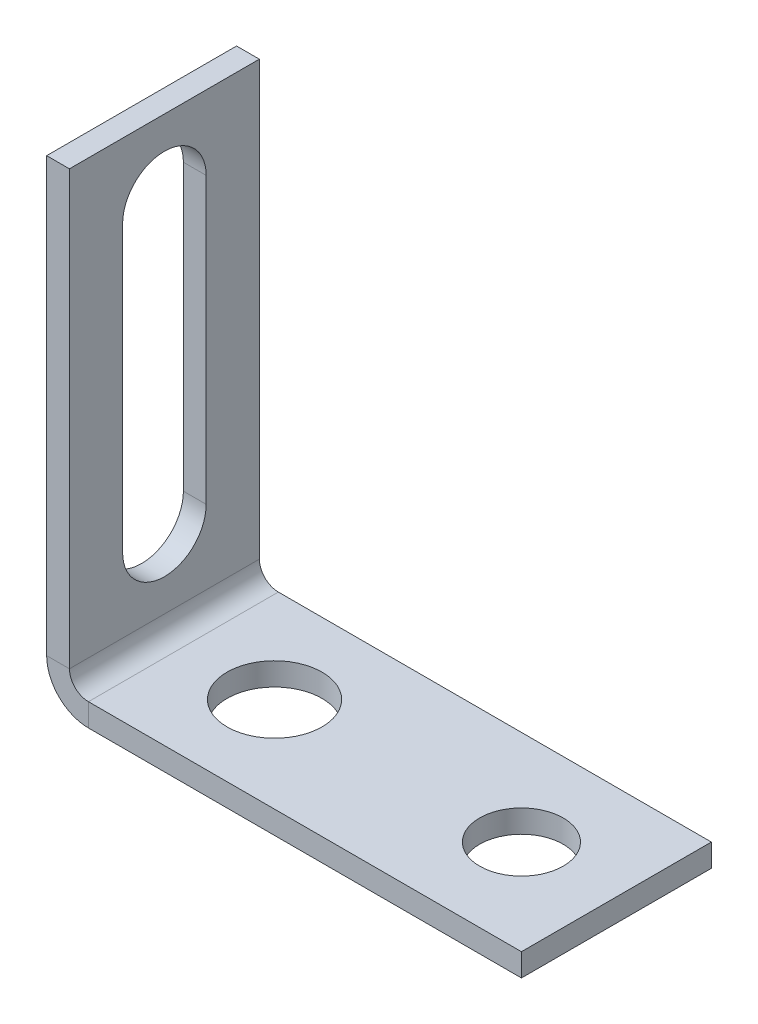
ISO-10303-21;
HEADER;
FILE_DESCRIPTION(('STEP AP214'),'2;1');
FILE_NAME('part.step','',(''),(''),'','','');
FILE_SCHEMA(('AUTOMOTIVE_DESIGN { 1 0 10303 214 1 1 1 1 }'));
ENDSEC;
DATA;
#1=APPLICATION_CONTEXT('core data for automotive mechanical design processes');
#2=APPLICATION_PROTOCOL_DEFINITION('international standard','automotive_design',2000,#1);
#3=PRODUCT_CONTEXT('',#1,'mechanical');
#4=PRODUCT('Part','Part','',(#3));
#5=PRODUCT_RELATED_PRODUCT_CATEGORY('part','',(#4));
#6=PRODUCT_DEFINITION_FORMATION('','',#4);
#7=PRODUCT_DEFINITION_CONTEXT('part definition',#1,'design');
#8=PRODUCT_DEFINITION('design','',#6,#7);
#9=PRODUCT_DEFINITION_SHAPE('','',#8);
#10=(LENGTH_UNIT() NAMED_UNIT(*) SI_UNIT(.MILLI.,.METRE.));
#11=(NAMED_UNIT(*) PLANE_ANGLE_UNIT() SI_UNIT($,.RADIAN.));
#12=(NAMED_UNIT(*) SI_UNIT($,.STERADIAN.) SOLID_ANGLE_UNIT());
#13=UNCERTAINTY_MEASURE_WITH_UNIT(LENGTH_MEASURE(1.E-05),#10,'distance_accuracy_value','');
#14=(GEOMETRIC_REPRESENTATION_CONTEXT(3) GLOBAL_UNCERTAINTY_ASSIGNED_CONTEXT((#13)) GLOBAL_UNIT_ASSIGNED_CONTEXT((#10,
#11,#12)) REPRESENTATION_CONTEXT('',''));
#15=CARTESIAN_POINT('',(0.,0.,0.));
#16=DIRECTION('',(0.,0.,1.));
#17=DIRECTION('',(1.,0.,0.));
#18=AXIS2_PLACEMENT_3D('',#15,#16,#17);
#19=CARTESIAN_POINT('',(0.,2.2,10.));
#20=DIRECTION('',(0.,0.,1.));
#21=DIRECTION('',(1.,0.,0.));
#22=AXIS2_PLACEMENT_3D('',#19,#20,#21);
#23=PLANE('',#22);
#24=DIRECTION('',(1.,0.,0.));
#25=VECTOR('',#24,1.);
#26=CARTESIAN_POINT('',(0.,2.2,10.));
#27=LINE('',#26,#25);
#28=CARTESIAN_POINT('',(0.,2.2,10.));
#29=VERTEX_POINT('',#28);
#30=CARTESIAN_POINT('',(1.2,2.2,10.));
#31=VERTEX_POINT('',#30);
#32=EDGE_CURVE('E11',#29,#31,#27,.T.);
#33=ORIENTED_EDGE('',*,*,#32,.F.);
#34=CARTESIAN_POINT('',(2.2,2.2,10.));
#35=DIRECTION('',(0.,0.,-1.));
#36=DIRECTION('',(-1.,0.,0.));
#37=AXIS2_PLACEMENT_3D('',#34,#35,#36);
#38=CIRCLE('',#37,2.2);
#39=CARTESIAN_POINT('',(2.2,0.,10.));
#40=VERTEX_POINT('',#39);
#41=EDGE_CURVE('E191',#29,#40,#38,.F.);
#42=ORIENTED_EDGE('',*,*,#41,.T.);
#43=DIRECTION('',(0.,-1.,0.));
#44=VECTOR('',#43,1.);
#45=CARTESIAN_POINT('',(2.2,1.2,10.));
#46=LINE('',#45,#44);
#47=CARTESIAN_POINT('',(2.2,1.2,10.));
#48=VERTEX_POINT('',#47);
#49=EDGE_CURVE('E41',#48,#40,#46,.T.);
#50=ORIENTED_EDGE('',*,*,#49,.F.);
#51=CARTESIAN_POINT('',(2.2,2.2,10.));
#52=DIRECTION('',(0.,0.,1.));
#53=DIRECTION('',(1.,0.,0.));
#54=AXIS2_PLACEMENT_3D('',#51,#52,#53);
#55=CIRCLE('',#54,1.);
#56=EDGE_CURVE('E179',#31,#48,#55,.T.);
#57=ORIENTED_EDGE('',*,*,#56,.F.);
#58=EDGE_LOOP('',(#33,#42,#50,#57));
#59=FACE_BOUND('',#58,.T.);
#60=ADVANCED_FACE('F34',(#59),#23,.T.);
#61=CARTESIAN_POINT('',(2.2,1.2,10.));
#62=DIRECTION('',(0.,0.,1.));
#63=DIRECTION('',(1.,0.,0.));
#64=AXIS2_PLACEMENT_3D('',#61,#62,#63);
#65=PLANE('',#64);
#66=DIRECTION('',(0.,-1.,0.));
#67=VECTOR('',#66,1.);
#68=CARTESIAN_POINT('',(0.,25.,10.));
#69=LINE('',#68,#67);
#70=CARTESIAN_POINT('',(0.,25.,10.));
#71=VERTEX_POINT('',#70);
#72=EDGE_CURVE('E188',#71,#29,#69,.T.);
#73=ORIENTED_EDGE('',*,*,#72,.T.);
#74=ORIENTED_EDGE('',*,*,#32,.T.);
#75=DIRECTION('',(0.,-1.,0.));
#76=VECTOR('',#75,1.);
#77=CARTESIAN_POINT('',(1.2,25.,10.));
#78=LINE('',#77,#76);
#79=CARTESIAN_POINT('',(1.2,25.,10.));
#80=VERTEX_POINT('',#79);
#81=EDGE_CURVE('E182',#80,#31,#78,.T.);
#82=ORIENTED_EDGE('',*,*,#81,.F.);
#83=DIRECTION('',(1.,0.,0.));
#84=VECTOR('',#83,1.);
#85=CARTESIAN_POINT('',(0.,25.,10.));
#86=LINE('',#85,#84);
#87=EDGE_CURVE('E185',#71,#80,#86,.T.);
#88=ORIENTED_EDGE('',*,*,#87,.F.);
#89=EDGE_LOOP('',(#73,#74,#82,#88));
#90=FACE_BOUND('',#89,.T.);
#91=ADVANCED_FACE('F272',(#90),#65,.T.);
#92=CARTESIAN_POINT('',(2.2,0.,0.));
#93=DIRECTION('',(0.,0.,-1.));
#94=DIRECTION('',(-1.,0.,0.));
#95=AXIS2_PLACEMENT_3D('',#92,#93,#94);
#96=PLANE('',#95);
#97=DIRECTION('',(0.,1.,0.));
#98=VECTOR('',#97,1.);
#99=CARTESIAN_POINT('',(2.2,0.,0.));
#100=LINE('',#99,#98);
#101=CARTESIAN_POINT('',(2.2,0.,0.));
#102=VERTEX_POINT('',#101);
#103=CARTESIAN_POINT('',(2.2,1.2,0.));
#104=VERTEX_POINT('',#103);
#105=EDGE_CURVE('E238',#102,#104,#100,.T.);
#106=ORIENTED_EDGE('',*,*,#105,.F.);
#107=CARTESIAN_POINT('',(2.2,2.2,0.));
#108=DIRECTION('',(0.,0.,-1.));
#109=DIRECTION('',(-1.,0.,0.));
#110=AXIS2_PLACEMENT_3D('',#107,#108,#109);
#111=CIRCLE('',#110,2.2);
#112=CARTESIAN_POINT('',(0.,2.2,0.));
#113=VERTEX_POINT('',#112);
#114=EDGE_CURVE('E173',#113,#102,#111,.F.);
#115=ORIENTED_EDGE('',*,*,#114,.F.);
#116=DIRECTION('',(-1.,0.,0.));
#117=VECTOR('',#116,1.);
#118=CARTESIAN_POINT('',(1.2,2.2,0.));
#119=LINE('',#118,#117);
#120=CARTESIAN_POINT('',(1.2,2.2,0.));
#121=VERTEX_POINT('',#120);
#122=EDGE_CURVE('E236',#121,#113,#119,.T.);
#123=ORIENTED_EDGE('',*,*,#122,.F.);
#124=CARTESIAN_POINT('',(2.2,2.2,0.));
#125=DIRECTION('',(0.,0.,1.));
#126=DIRECTION('',(1.,0.,0.));
#127=AXIS2_PLACEMENT_3D('',#124,#125,#126);
#128=CIRCLE('',#127,1.);
#129=EDGE_CURVE('E203',#121,#104,#128,.T.);
#130=ORIENTED_EDGE('',*,*,#129,.T.);
#131=EDGE_LOOP('',(#106,#115,#123,#130));
#132=FACE_BOUND('',#131,.T.);
#133=ADVANCED_FACE('F280',(#132),#96,.T.);
#134=CARTESIAN_POINT('',(1.2,2.2,0.));
#135=DIRECTION('',(0.,0.,-1.));
#136=DIRECTION('',(-1.,0.,0.));
#137=AXIS2_PLACEMENT_3D('',#134,#135,#136);
#138=PLANE('',#137);
#139=DIRECTION('',(1.,0.,0.));
#140=VECTOR('',#139,1.);
#141=CARTESIAN_POINT('',(0.,0.,0.));
#142=LINE('',#141,#140);
#143=CARTESIAN_POINT('',(25.,0.,0.));
#144=VERTEX_POINT('',#143);
#145=EDGE_CURVE('E165',#102,#144,#142,.T.);
#146=ORIENTED_EDGE('',*,*,#145,.F.);
#147=ORIENTED_EDGE('',*,*,#105,.T.);
#148=DIRECTION('',(1.,0.,0.));
#149=VECTOR('',#148,1.);
#150=CARTESIAN_POINT('',(0.,1.2,0.));
#151=LINE('',#150,#149);
#152=CARTESIAN_POINT('',(25.,1.2,0.));
#153=VERTEX_POINT('',#152);
#154=EDGE_CURVE('E200',#104,#153,#151,.T.);
#155=ORIENTED_EDGE('',*,*,#154,.T.);
#156=DIRECTION('',(0.,-1.,0.));
#157=VECTOR('',#156,1.);
#158=CARTESIAN_POINT('',(25.,1.2,0.));
#159=LINE('',#158,#157);
#160=EDGE_CURVE('E197',#153,#144,#159,.T.);
#161=ORIENTED_EDGE('',*,*,#160,.T.);
#162=EDGE_LOOP('',(#146,#147,#155,#161));
#163=FACE_BOUND('',#162,.T.);
#164=ADVANCED_FACE('F282',(#163),#138,.T.);
#165=CARTESIAN_POINT('',(0.,0.,10.));
#166=DIRECTION('',(0.,1.,0.));
#167=DIRECTION('',(0.,0.,1.));
#168=AXIS2_PLACEMENT_3D('',#165,#166,#167);
#169=PLANE('',#168);
#170=CARTESIAN_POINT('',(20.,0.,5.));
#171=DIRECTION('',(0.,1.,0.));
#172=DIRECTION('',(0.,0.,1.));
#173=AXIS2_PLACEMENT_3D('',#170,#171,#172);
#174=CIRCLE('',#173,2.2);
#175=CARTESIAN_POINT('',(20.,0.,7.2));
#176=VERTEX_POINT('',#175);
#177=EDGE_CURVE('E161',#176,#176,#174,.F.);
#178=ORIENTED_EDGE('',*,*,#177,.F.);
#179=EDGE_LOOP('',(#178));
#180=FACE_BOUND('',#179,.T.);
#181=CARTESIAN_POINT('',(7.,0.,5.));
#182=DIRECTION('',(0.,1.,0.));
#183=DIRECTION('',(0.,0.,1.));
#184=AXIS2_PLACEMENT_3D('',#181,#182,#183);
#185=CIRCLE('',#184,2.5);
#186=CARTESIAN_POINT('',(7.,0.,7.5));
#187=VERTEX_POINT('',#186);
#188=EDGE_CURVE('E162',#187,#187,#185,.F.);
#189=ORIENTED_EDGE('',*,*,#188,.F.);
#190=EDGE_LOOP('',(#189));
#191=FACE_BOUND('',#190,.T.);
#192=ORIENTED_EDGE('',*,*,#145,.T.);
#193=DIRECTION('',(0.,0.,-1.));
#194=VECTOR('',#193,1.);
#195=CARTESIAN_POINT('',(25.,0.,10.));
#196=LINE('',#195,#194);
#197=CARTESIAN_POINT('',(25.,0.,10.));
#198=VERTEX_POINT('',#197);
#199=EDGE_CURVE('E234',#198,#144,#196,.T.);
#200=ORIENTED_EDGE('',*,*,#199,.F.);
#201=DIRECTION('',(1.,0.,0.));
#202=VECTOR('',#201,1.);
#203=CARTESIAN_POINT('',(0.,0.,10.));
#204=LINE('',#203,#202);
#205=EDGE_CURVE('E170',#40,#198,#204,.T.);
#206=ORIENTED_EDGE('',*,*,#205,.F.);
#207=DIRECTION('',(0.,0.,-1.));
#208=VECTOR('',#207,1.);
#209=CARTESIAN_POINT('',(2.2,0.,10.));
#210=LINE('',#209,#208);
#211=EDGE_CURVE('E194',#40,#102,#210,.T.);
#212=ORIENTED_EDGE('',*,*,#211,.T.);
#213=EDGE_LOOP('',(#192,#200,#206,#212));
#214=FACE_BOUND('',#213,.T.);
#215=ADVANCED_FACE('F255',(#180,#191,#214),#169,.F.);
#216=CARTESIAN_POINT('',(25.,1.2,10.));
#217=DIRECTION('',(1.,0.,0.));
#218=DIRECTION('',(0.,0.,-1.));
#219=AXIS2_PLACEMENT_3D('',#216,#217,#218);
#220=PLANE('',#219);
#221=ORIENTED_EDGE('',*,*,#160,.F.);
#222=DIRECTION('',(0.,0.,-1.));
#223=VECTOR('',#222,1.);
#224=CARTESIAN_POINT('',(25.,1.2,10.));
#225=LINE('',#224,#223);
#226=CARTESIAN_POINT('',(25.,1.2,10.));
#227=VERTEX_POINT('',#226);
#228=EDGE_CURVE('E232',#227,#153,#225,.T.);
#229=ORIENTED_EDGE('',*,*,#228,.F.);
#230=DIRECTION('',(0.,-1.,0.));
#231=VECTOR('',#230,1.);
#232=CARTESIAN_POINT('',(25.,1.2,10.));
#233=LINE('',#232,#231);
#234=EDGE_CURVE('E172',#227,#198,#233,.T.);
#235=ORIENTED_EDGE('',*,*,#234,.T.);
#236=ORIENTED_EDGE('',*,*,#199,.T.);
#237=EDGE_LOOP('',(#221,#229,#235,#236));
#238=FACE_BOUND('',#237,.T.);
#239=ADVANCED_FACE('F258',(#238),#220,.T.);
#240=CARTESIAN_POINT('',(0.,1.2,10.));
#241=DIRECTION('',(0.,1.,0.));
#242=DIRECTION('',(0.,0.,1.));
#243=AXIS2_PLACEMENT_3D('',#240,#241,#242);
#244=PLANE('',#243);
#245=CARTESIAN_POINT('',(20.,1.2,5.));
#246=DIRECTION('',(0.,1.,0.));
#247=DIRECTION('',(0.,0.,1.));
#248=AXIS2_PLACEMENT_3D('',#245,#246,#247);
#249=CIRCLE('',#248,2.2);
#250=CARTESIAN_POINT('',(20.,1.2,7.2));
#251=VERTEX_POINT('',#250);
#252=EDGE_CURVE('E158',#251,#251,#249,.T.);
#253=ORIENTED_EDGE('',*,*,#252,.F.);
#254=EDGE_LOOP('',(#253));
#255=FACE_BOUND('',#254,.T.);
#256=CARTESIAN_POINT('',(7.,1.2,5.));
#257=DIRECTION('',(0.,1.,0.));
#258=DIRECTION('',(0.,0.,1.));
#259=AXIS2_PLACEMENT_3D('',#256,#257,#258);
#260=CIRCLE('',#259,2.5);
#261=CARTESIAN_POINT('',(7.,1.2,7.5));
#262=VERTEX_POINT('',#261);
#263=EDGE_CURVE('E135',#262,#262,#260,.T.);
#264=ORIENTED_EDGE('',*,*,#263,.F.);
#265=EDGE_LOOP('',(#264));
#266=FACE_BOUND('',#265,.T.);
#267=ORIENTED_EDGE('',*,*,#154,.F.);
#268=DIRECTION('',(0.,0.,-1.));
#269=VECTOR('',#268,1.);
#270=CARTESIAN_POINT('',(2.2,1.2,10.));
#271=LINE('',#270,#269);
#272=EDGE_CURVE('E229',#48,#104,#271,.T.);
#273=ORIENTED_EDGE('',*,*,#272,.F.);
#274=DIRECTION('',(1.,0.,0.));
#275=VECTOR('',#274,1.);
#276=CARTESIAN_POINT('',(0.,1.2,10.));
#277=LINE('',#276,#275);
#278=EDGE_CURVE('E176',#48,#227,#277,.T.);
#279=ORIENTED_EDGE('',*,*,#278,.T.);
#280=ORIENTED_EDGE('',*,*,#228,.T.);
#281=EDGE_LOOP('',(#267,#273,#279,#280));
#282=FACE_BOUND('',#281,.T.);
#283=ADVANCED_FACE('F261',(#255,#266,#282),#244,.T.);
#284=CARTESIAN_POINT('',(2.2,2.2,10.));
#285=DIRECTION('',(0.,0.,-1.));
#286=DIRECTION('',(-1.,0.,0.));
#287=AXIS2_PLACEMENT_3D('',#284,#285,#286);
#288=CYLINDRICAL_SURFACE('',#287,1.);
#289=ORIENTED_EDGE('',*,*,#129,.F.);
#290=DIRECTION('',(0.,0.,-1.));
#291=VECTOR('',#290,1.);
#292=CARTESIAN_POINT('',(1.2,2.2,10.));
#293=LINE('',#292,#291);
#294=EDGE_CURVE('E226',#31,#121,#293,.T.);
#295=ORIENTED_EDGE('',*,*,#294,.F.);
#296=ORIENTED_EDGE('',*,*,#56,.T.);
#297=ORIENTED_EDGE('',*,*,#272,.T.);
#298=EDGE_LOOP('',(#289,#295,#296,#297));
#299=FACE_BOUND('',#298,.T.);
#300=ADVANCED_FACE('F264',(#299),#288,.F.);
#301=CARTESIAN_POINT('',(1.2,25.,10.));
#302=DIRECTION('',(1.,0.,0.));
#303=DIRECTION('',(0.,1.,0.));
#304=AXIS2_PLACEMENT_3D('',#301,#302,#303);
#305=PLANE('',#304);
#306=CARTESIAN_POINT('',(1.2,21.1,5.));
#307=DIRECTION('',(1.,0.,0.));
#308=DIRECTION('',(0.,1.,0.));
#309=AXIS2_PLACEMENT_3D('',#306,#307,#308);
#310=CIRCLE('',#309,2.2);
#311=CARTESIAN_POINT('',(1.2,21.1,2.8));
#312=VERTEX_POINT('',#311);
#313=CARTESIAN_POINT('',(1.2,21.1,7.2));
#314=VERTEX_POINT('',#313);
#315=EDGE_CURVE('E48',#312,#314,#310,.T.);
#316=ORIENTED_EDGE('',*,*,#315,.F.);
#317=DIRECTION('',(0.,1.,0.));
#318=VECTOR('',#317,1.);
#319=CARTESIAN_POINT('',(1.2,21.1,2.8));
#320=LINE('',#319,#318);
#321=CARTESIAN_POINT('',(1.2,6.1,2.8));
#322=VERTEX_POINT('',#321);
#323=EDGE_CURVE('E129',#322,#312,#320,.T.);
#324=ORIENTED_EDGE('',*,*,#323,.F.);
#325=CARTESIAN_POINT('',(1.2,6.1,5.));
#326=DIRECTION('',(1.,0.,0.));
#327=DIRECTION('',(0.,1.,0.));
#328=AXIS2_PLACEMENT_3D('',#325,#326,#327);
#329=CIRCLE('',#328,2.2);
#330=CARTESIAN_POINT('',(1.2,6.1,7.2));
#331=VERTEX_POINT('',#330);
#332=EDGE_CURVE('E149',#331,#322,#329,.T.);
#333=ORIENTED_EDGE('',*,*,#332,.F.);
#334=DIRECTION('',(0.,-1.,0.));
#335=VECTOR('',#334,1.);
#336=CARTESIAN_POINT('',(1.2,21.1,7.2));
#337=LINE('',#336,#335);
#338=EDGE_CURVE('E143',#314,#331,#337,.T.);
#339=ORIENTED_EDGE('',*,*,#338,.F.);
#340=EDGE_LOOP('',(#316,#324,#333,#339));
#341=FACE_BOUND('',#340,.T.);
#342=DIRECTION('',(0.,-1.,0.));
#343=VECTOR('',#342,1.);
#344=CARTESIAN_POINT('',(1.2,25.,0.));
#345=LINE('',#344,#343);
#346=CARTESIAN_POINT('',(1.2,25.,0.));
#347=VERTEX_POINT('',#346);
#348=EDGE_CURVE('E206',#347,#121,#345,.T.);
#349=ORIENTED_EDGE('',*,*,#348,.F.);
#350=DIRECTION('',(0.,0.,-1.));
#351=VECTOR('',#350,1.);
#352=CARTESIAN_POINT('',(1.2,25.,10.));
#353=LINE('',#352,#351);
#354=EDGE_CURVE('E224',#80,#347,#353,.T.);
#355=ORIENTED_EDGE('',*,*,#354,.F.);
#356=ORIENTED_EDGE('',*,*,#81,.T.);
#357=ORIENTED_EDGE('',*,*,#294,.T.);
#358=EDGE_LOOP('',(#349,#355,#356,#357));
#359=FACE_BOUND('',#358,.T.);
#360=ADVANCED_FACE('F269',(#341,#359),#305,.T.);
#361=CARTESIAN_POINT('',(0.,25.,10.));
#362=DIRECTION('',(0.,1.,0.));
#363=DIRECTION('',(0.,0.,1.));
#364=AXIS2_PLACEMENT_3D('',#361,#362,#363);
#365=PLANE('',#364);
#366=DIRECTION('',(1.,0.,0.));
#367=VECTOR('',#366,1.);
#368=CARTESIAN_POINT('',(0.,25.,0.));
#369=LINE('',#368,#367);
#370=CARTESIAN_POINT('',(0.,25.,0.));
#371=VERTEX_POINT('',#370);
#372=EDGE_CURVE('E209',#371,#347,#369,.T.);
#373=ORIENTED_EDGE('',*,*,#372,.F.);
#374=DIRECTION('',(0.,0.,-1.));
#375=VECTOR('',#374,1.);
#376=CARTESIAN_POINT('',(0.,25.,10.));
#377=LINE('',#376,#375);
#378=EDGE_CURVE('E222',#71,#371,#377,.T.);
#379=ORIENTED_EDGE('',*,*,#378,.F.);
#380=ORIENTED_EDGE('',*,*,#87,.T.);
#381=ORIENTED_EDGE('',*,*,#354,.T.);
#382=EDGE_LOOP('',(#373,#379,#380,#381));
#383=FACE_BOUND('',#382,.T.);
#384=ADVANCED_FACE('F275',(#383),#365,.T.);
#385=CARTESIAN_POINT('',(0.,25.,10.));
#386=DIRECTION('',(1.,0.,0.));
#387=DIRECTION('',(0.,1.,0.));
#388=AXIS2_PLACEMENT_3D('',#385,#386,#387);
#389=PLANE('',#388);
#390=DIRECTION('',(0.,-1.,0.));
#391=VECTOR('',#390,1.);
#392=CARTESIAN_POINT('',(0.,21.1,2.8));
#393=LINE('',#392,#391);
#394=CARTESIAN_POINT('',(0.,21.1,2.8));
#395=VERTEX_POINT('',#394);
#396=CARTESIAN_POINT('',(0.,6.1,2.8));
#397=VERTEX_POINT('',#396);
#398=EDGE_CURVE('E141',#395,#397,#393,.T.);
#399=ORIENTED_EDGE('',*,*,#398,.F.);
#400=CARTESIAN_POINT('',(0.,21.1,5.));
#401=DIRECTION('',(1.,0.,0.));
#402=DIRECTION('',(0.,1.,0.));
#403=AXIS2_PLACEMENT_3D('',#400,#401,#402);
#404=CIRCLE('',#403,2.2);
#405=CARTESIAN_POINT('',(0.,21.1,7.2));
#406=VERTEX_POINT('',#405);
#407=EDGE_CURVE('E123',#406,#395,#404,.F.);
#408=ORIENTED_EDGE('',*,*,#407,.F.);
#409=DIRECTION('',(0.,1.,0.));
#410=VECTOR('',#409,1.);
#411=CARTESIAN_POINT('',(0.,21.1,7.2));
#412=LINE('',#411,#410);
#413=CARTESIAN_POINT('',(0.,6.1,7.2));
#414=VERTEX_POINT('',#413);
#415=EDGE_CURVE('E132',#414,#406,#412,.T.);
#416=ORIENTED_EDGE('',*,*,#415,.F.);
#417=CARTESIAN_POINT('',(0.,6.1,5.));
#418=DIRECTION('',(1.,0.,0.));
#419=DIRECTION('',(0.,1.,0.));
#420=AXIS2_PLACEMENT_3D('',#417,#418,#419);
#421=CIRCLE('',#420,2.2);
#422=EDGE_CURVE('E56',#397,#414,#421,.F.);
#423=ORIENTED_EDGE('',*,*,#422,.F.);
#424=EDGE_LOOP('',(#399,#408,#416,#423));
#425=FACE_BOUND('',#424,.T.);
#426=DIRECTION('',(0.,-1.,0.));
#427=VECTOR('',#426,1.);
#428=CARTESIAN_POINT('',(0.,25.,0.));
#429=LINE('',#428,#427);
#430=EDGE_CURVE('E212',#371,#113,#429,.T.);
#431=ORIENTED_EDGE('',*,*,#430,.T.);
#432=DIRECTION('',(0.,0.,-1.));
#433=VECTOR('',#432,1.);
#434=CARTESIAN_POINT('',(0.,2.2,10.));
#435=LINE('',#434,#433);
#436=EDGE_CURVE('E219',#29,#113,#435,.T.);
#437=ORIENTED_EDGE('',*,*,#436,.F.);
#438=ORIENTED_EDGE('',*,*,#72,.F.);
#439=ORIENTED_EDGE('',*,*,#378,.T.);
#440=EDGE_LOOP('',(#431,#437,#438,#439));
#441=FACE_BOUND('',#440,.T.);
#442=ADVANCED_FACE('F138',(#425,#441),#389,.F.);
#443=CARTESIAN_POINT('',(2.2,2.2,10.));
#444=DIRECTION('',(0.,0.,-1.));
#445=DIRECTION('',(-1.,0.,0.));
#446=AXIS2_PLACEMENT_3D('',#443,#444,#445);
#447=CYLINDRICAL_SURFACE('',#446,2.2);
#448=ORIENTED_EDGE('',*,*,#114,.T.);
#449=ORIENTED_EDGE('',*,*,#211,.F.);
#450=ORIENTED_EDGE('',*,*,#41,.F.);
#451=ORIENTED_EDGE('',*,*,#436,.T.);
#452=EDGE_LOOP('',(#448,#449,#450,#451));
#453=FACE_BOUND('',#452,.T.);
#454=ADVANCED_FACE('F251',(#453),#447,.T.);
#455=CARTESIAN_POINT('',(2.2,2.2,10.));
#456=DIRECTION('',(0.,0.,1.));
#457=DIRECTION('',(1.,0.,0.));
#458=AXIS2_PLACEMENT_3D('',#455,#456,#457);
#459=PLANE('',#458);
#460=ORIENTED_EDGE('',*,*,#205,.T.);
#461=ORIENTED_EDGE('',*,*,#234,.F.);
#462=ORIENTED_EDGE('',*,*,#278,.F.);
#463=ORIENTED_EDGE('',*,*,#49,.T.);
#464=EDGE_LOOP('',(#460,#461,#462,#463));
#465=FACE_BOUND('',#464,.T.);
#466=ADVANCED_FACE('F241',(#465),#459,.T.);
#467=CARTESIAN_POINT('',(2.2,2.2,0.));
#468=DIRECTION('',(0.,0.,1.));
#469=DIRECTION('',(1.,0.,0.));
#470=AXIS2_PLACEMENT_3D('',#467,#468,#469);
#471=PLANE('',#470);
#472=ORIENTED_EDGE('',*,*,#348,.T.);
#473=ORIENTED_EDGE('',*,*,#122,.T.);
#474=ORIENTED_EDGE('',*,*,#430,.F.);
#475=ORIENTED_EDGE('',*,*,#372,.T.);
#476=EDGE_LOOP('',(#472,#473,#474,#475));
#477=FACE_BOUND('',#476,.T.);
#478=ADVANCED_FACE('F360',(#477),#471,.F.);
#479=CARTESIAN_POINT('',(7.,-0.000999999999999916,5.));
#480=DIRECTION('',(0.,1.,0.));
#481=DIRECTION('',(0.,0.,1.));
#482=AXIS2_PLACEMENT_3D('',#479,#480,#481);
#483=CYLINDRICAL_SURFACE('',#482,2.5);
#484=ORIENTED_EDGE('',*,*,#263,.T.);
#485=EDGE_LOOP('',(#484));
#486=FACE_BOUND('',#485,.T.);
#487=ORIENTED_EDGE('',*,*,#188,.T.);
#488=EDGE_LOOP('',(#487));
#489=FACE_BOUND('',#488,.T.);
#490=ADVANCED_FACE('F370',(#486,#489),#483,.F.);
#491=CARTESIAN_POINT('',(20.,-0.000999999999999916,5.));
#492=DIRECTION('',(0.,1.,0.));
#493=DIRECTION('',(0.,0.,1.));
#494=AXIS2_PLACEMENT_3D('',#491,#492,#493);
#495=CYLINDRICAL_SURFACE('',#494,2.2);
#496=ORIENTED_EDGE('',*,*,#252,.T.);
#497=EDGE_LOOP('',(#496));
#498=FACE_BOUND('',#497,.T.);
#499=ORIENTED_EDGE('',*,*,#177,.T.);
#500=EDGE_LOOP('',(#499));
#501=FACE_BOUND('',#500,.T.);
#502=ADVANCED_FACE('F395',(#498,#501),#495,.F.);
#503=CARTESIAN_POINT('',(-0.00100000000000122,21.1,5.));
#504=DIRECTION('',(1.,0.,0.));
#505=DIRECTION('',(0.,1.,0.));
#506=AXIS2_PLACEMENT_3D('',#503,#504,#505);
#507=CYLINDRICAL_SURFACE('',#506,2.2);
#508=ORIENTED_EDGE('',*,*,#407,.T.);
#509=DIRECTION('',(1.,0.,0.));
#510=VECTOR('',#509,1.);
#511=CARTESIAN_POINT('',(-0.00100000000000122,21.1,2.8));
#512=LINE('',#511,#510);
#513=EDGE_CURVE('E136',#395,#312,#512,.T.);
#514=ORIENTED_EDGE('',*,*,#513,.T.);
#515=ORIENTED_EDGE('',*,*,#315,.T.);
#516=DIRECTION('',(1.,0.,0.));
#517=VECTOR('',#516,1.);
#518=CARTESIAN_POINT('',(-0.00100000000000122,21.1,7.2));
#519=LINE('',#518,#517);
#520=EDGE_CURVE('E119',#406,#314,#519,.T.);
#521=ORIENTED_EDGE('',*,*,#520,.F.);
#522=EDGE_LOOP('',(#508,#514,#515,#521));
#523=FACE_BOUND('',#522,.T.);
#524=ADVANCED_FACE('F121',(#523),#507,.F.);
#525=CARTESIAN_POINT('',(-0.00100000000000122,21.1,2.8));
#526=DIRECTION('',(0.,0.,-1.));
#527=DIRECTION('',(-1.,0.,0.));
#528=AXIS2_PLACEMENT_3D('',#525,#526,#527);
#529=PLANE('',#528);
#530=ORIENTED_EDGE('',*,*,#398,.T.);
#531=DIRECTION('',(1.,0.,0.));
#532=VECTOR('',#531,1.);
#533=CARTESIAN_POINT('',(-0.00100000000000187,6.1,2.8));
#534=LINE('',#533,#532);
#535=EDGE_CURVE('E155',#397,#322,#534,.T.);
#536=ORIENTED_EDGE('',*,*,#535,.T.);
#537=ORIENTED_EDGE('',*,*,#323,.T.);
#538=ORIENTED_EDGE('',*,*,#513,.F.);
#539=EDGE_LOOP('',(#530,#536,#537,#538));
#540=FACE_BOUND('',#539,.T.);
#541=ADVANCED_FACE('F431',(#540),#529,.F.);
#542=CARTESIAN_POINT('',(-0.00100000000000187,6.1,5.));
#543=DIRECTION('',(1.,0.,0.));
#544=DIRECTION('',(0.,1.,0.));
#545=AXIS2_PLACEMENT_3D('',#542,#543,#544);
#546=CYLINDRICAL_SURFACE('',#545,2.2);
#547=ORIENTED_EDGE('',*,*,#422,.T.);
#548=DIRECTION('',(1.,0.,0.));
#549=VECTOR('',#548,1.);
#550=CARTESIAN_POINT('',(-0.00100000000000187,6.1,7.2));
#551=LINE('',#550,#549);
#552=EDGE_CURVE('E128',#414,#331,#551,.T.);
#553=ORIENTED_EDGE('',*,*,#552,.T.);
#554=ORIENTED_EDGE('',*,*,#332,.T.);
#555=ORIENTED_EDGE('',*,*,#535,.F.);
#556=EDGE_LOOP('',(#547,#553,#554,#555));
#557=FACE_BOUND('',#556,.T.);
#558=ADVANCED_FACE('F441',(#557),#546,.F.);
#559=CARTESIAN_POINT('',(-0.00100000000000122,21.1,7.2));
#560=DIRECTION('',(0.,0.,1.));
#561=DIRECTION('',(1.,0.,0.));
#562=AXIS2_PLACEMENT_3D('',#559,#560,#561);
#563=PLANE('',#562);
#564=ORIENTED_EDGE('',*,*,#415,.T.);
#565=ORIENTED_EDGE('',*,*,#520,.T.);
#566=ORIENTED_EDGE('',*,*,#338,.T.);
#567=ORIENTED_EDGE('',*,*,#552,.F.);
#568=EDGE_LOOP('',(#564,#565,#566,#567));
#569=FACE_BOUND('',#568,.T.);
#570=ADVANCED_FACE('F133',(#569),#563,.F.);
#571=CLOSED_SHELL('',(#60,#91,#133,#164,#215,#239,#283,#300,#360,#384,#442,#454,#466,#478,#490,
#502,#524,#541,#558,#570));
#572=MANIFOLD_SOLID_BREP('B2',#571);
#573=ADVANCED_BREP_SHAPE_REPRESENTATION('',(#18,#572),#14);
#574=SHAPE_DEFINITION_REPRESENTATION(#9,#573);
ENDSEC;
END-ISO-10303-21;
